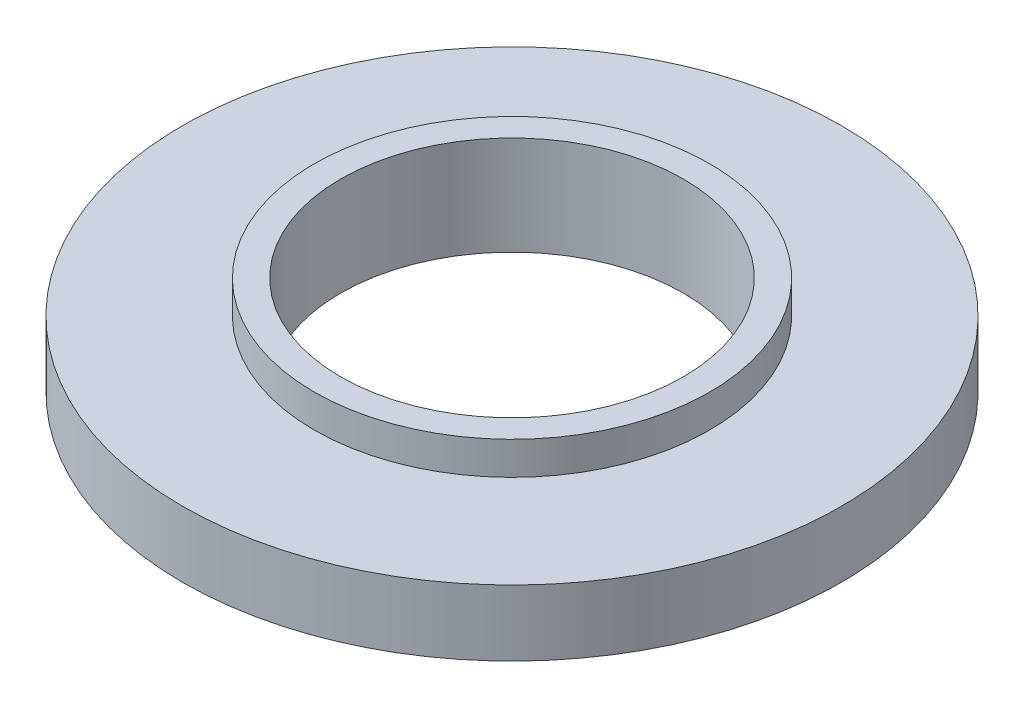
ISO-10303-21;
HEADER;
FILE_DESCRIPTION(('STEP AP214'),'2;1');
FILE_NAME('part.step','',(''),(''),'','','');
FILE_SCHEMA(('AUTOMOTIVE_DESIGN { 1 0 10303 214 1 1 1 1 }'));
ENDSEC;
DATA;
#1=APPLICATION_CONTEXT('core data for automotive mechanical design processes');
#2=APPLICATION_PROTOCOL_DEFINITION('international standard','automotive_design',2000,#1);
#3=PRODUCT_CONTEXT('',#1,'mechanical');
#4=PRODUCT('Part','Part','',(#3));
#5=PRODUCT_RELATED_PRODUCT_CATEGORY('part','',(#4));
#6=PRODUCT_DEFINITION_FORMATION('','',#4);
#7=PRODUCT_DEFINITION_CONTEXT('part definition',#1,'design');
#8=PRODUCT_DEFINITION('design','',#6,#7);
#9=PRODUCT_DEFINITION_SHAPE('','',#8);
#10=(LENGTH_UNIT() NAMED_UNIT(*) SI_UNIT(.MILLI.,.METRE.));
#11=(NAMED_UNIT(*) PLANE_ANGLE_UNIT() SI_UNIT($,.RADIAN.));
#12=(NAMED_UNIT(*) SI_UNIT($,.STERADIAN.) SOLID_ANGLE_UNIT());
#13=UNCERTAINTY_MEASURE_WITH_UNIT(LENGTH_MEASURE(1.E-05),#10,'distance_accuracy_value','');
#14=(GEOMETRIC_REPRESENTATION_CONTEXT(3) GLOBAL_UNCERTAINTY_ASSIGNED_CONTEXT((#13)) GLOBAL_UNIT_ASSIGNED_CONTEXT((#10,
#11,#12)) REPRESENTATION_CONTEXT('',''));
#15=CARTESIAN_POINT('',(0.,0.,0.));
#16=DIRECTION('',(0.,0.,1.));
#17=DIRECTION('',(1.,0.,0.));
#18=AXIS2_PLACEMENT_3D('',#15,#16,#17);
#19=CARTESIAN_POINT('',(2.6,1.5,0.));
#20=DIRECTION('',(0.,-1.,0.));
#21=DIRECTION('',(0.,0.,-1.));
#22=AXIS2_PLACEMENT_3D('',#19,#20,#21);
#23=PLANE('',#22);
#24=CARTESIAN_POINT('',(0.,1.5,0.));
#25=DIRECTION('',(0.,1.,0.));
#26=DIRECTION('',(0.,0.,1.));
#27=AXIS2_PLACEMENT_3D('',#24,#25,#26);
#28=CIRCLE('',#27,2.6);
#29=CARTESIAN_POINT('',(0.,1.5,2.6));
#30=VERTEX_POINT('',#29);
#31=EDGE_CURVE('E68',#30,#30,#28,.T.);
#32=ORIENTED_EDGE('',*,*,#31,.F.);
#33=EDGE_LOOP('',(#32));
#34=FACE_BOUND('',#33,.T.);
#35=CARTESIAN_POINT('',(0.,1.5,0.));
#36=DIRECTION('',(0.,1.,0.));
#37=DIRECTION('',(0.,0.,1.));
#38=AXIS2_PLACEMENT_3D('',#35,#36,#37);
#39=CIRCLE('',#38,3.);
#40=CARTESIAN_POINT('',(0.,1.5,3.));
#41=VERTEX_POINT('',#40);
#42=EDGE_CURVE('E10',#41,#41,#39,.T.);
#43=ORIENTED_EDGE('',*,*,#42,.T.);
#44=EDGE_LOOP('',(#43));
#45=FACE_BOUND('',#44,.T.);
#46=ADVANCED_FACE('F41',(#34,#45),#23,.F.);
#47=CARTESIAN_POINT('',(0.,8.66096866096866,0.));
#48=DIRECTION('',(0.,1.,0.));
#49=DIRECTION('',(0.,0.,1.));
#50=AXIS2_PLACEMENT_3D('',#47,#48,#49);
#51=CYLINDRICAL_SURFACE('',#50,3.);
#52=ORIENTED_EDGE('',*,*,#42,.F.);
#53=EDGE_LOOP('',(#52));
#54=FACE_BOUND('',#53,.T.);
#55=CARTESIAN_POINT('',(0.,1.,0.));
#56=DIRECTION('',(0.,1.,0.));
#57=DIRECTION('',(0.,0.,1.));
#58=AXIS2_PLACEMENT_3D('',#55,#56,#57);
#59=CIRCLE('',#58,3.);
#60=CARTESIAN_POINT('',(0.,1.,3.));
#61=VERTEX_POINT('',#60);
#62=EDGE_CURVE('E48',#61,#61,#59,.T.);
#63=ORIENTED_EDGE('',*,*,#62,.T.);
#64=EDGE_LOOP('',(#63));
#65=FACE_BOUND('',#64,.T.);
#66=ADVANCED_FACE('F76',(#54,#65),#51,.T.);
#67=CARTESIAN_POINT('',(3.,1.,0.));
#68=DIRECTION('',(0.,-1.,0.));
#69=DIRECTION('',(0.,0.,-1.));
#70=AXIS2_PLACEMENT_3D('',#67,#68,#69);
#71=PLANE('',#70);
#72=ORIENTED_EDGE('',*,*,#62,.F.);
#73=EDGE_LOOP('',(#72));
#74=FACE_BOUND('',#73,.T.);
#75=CARTESIAN_POINT('',(0.,1.,0.));
#76=DIRECTION('',(0.,1.,0.));
#77=DIRECTION('',(0.,0.,1.));
#78=AXIS2_PLACEMENT_3D('',#75,#76,#77);
#79=CIRCLE('',#78,5.);
#80=CARTESIAN_POINT('',(0.,1.,5.));
#81=VERTEX_POINT('',#80);
#82=EDGE_CURVE('E53',#81,#81,#79,.T.);
#83=ORIENTED_EDGE('',*,*,#82,.T.);
#84=EDGE_LOOP('',(#83));
#85=FACE_BOUND('',#84,.T.);
#86=ADVANCED_FACE('F80',(#74,#85),#71,.F.);
#87=CARTESIAN_POINT('',(0.,8.66096866096866,0.));
#88=DIRECTION('',(0.,1.,0.));
#89=DIRECTION('',(0.,0.,1.));
#90=AXIS2_PLACEMENT_3D('',#87,#88,#89);
#91=CYLINDRICAL_SURFACE('',#90,5.);
#92=ORIENTED_EDGE('',*,*,#82,.F.);
#93=EDGE_LOOP('',(#92));
#94=FACE_BOUND('',#93,.T.);
#95=CARTESIAN_POINT('',(0.,0.,0.));
#96=DIRECTION('',(0.,1.,0.));
#97=DIRECTION('',(0.,0.,1.));
#98=AXIS2_PLACEMENT_3D('',#95,#96,#97);
#99=CIRCLE('',#98,5.);
#100=CARTESIAN_POINT('',(0.,0.,5.));
#101=VERTEX_POINT('',#100);
#102=EDGE_CURVE('E58',#101,#101,#99,.T.);
#103=ORIENTED_EDGE('',*,*,#102,.T.);
#104=EDGE_LOOP('',(#103));
#105=FACE_BOUND('',#104,.T.);
#106=ADVANCED_FACE('F85',(#94,#105),#91,.T.);
#107=CARTESIAN_POINT('',(5.,0.,0.));
#108=DIRECTION('',(0.,1.,0.));
#109=DIRECTION('',(0.,0.,1.));
#110=AXIS2_PLACEMENT_3D('',#107,#108,#109);
#111=PLANE('',#110);
#112=ORIENTED_EDGE('',*,*,#102,.F.);
#113=EDGE_LOOP('',(#112));
#114=FACE_BOUND('',#113,.T.);
#115=CARTESIAN_POINT('',(0.,0.,0.));
#116=DIRECTION('',(0.,1.,0.));
#117=DIRECTION('',(0.,0.,1.));
#118=AXIS2_PLACEMENT_3D('',#115,#116,#117);
#119=CIRCLE('',#118,2.6);
#120=CARTESIAN_POINT('',(0.,0.,2.6));
#121=VERTEX_POINT('',#120);
#122=EDGE_CURVE('E64',#121,#121,#119,.T.);
#123=ORIENTED_EDGE('',*,*,#122,.T.);
#124=EDGE_LOOP('',(#123));
#125=FACE_BOUND('',#124,.T.);
#126=ADVANCED_FACE('F91',(#114,#125),#111,.F.);
#127=CARTESIAN_POINT('',(0.,8.66096866096866,0.));
#128=DIRECTION('',(0.,1.,0.));
#129=DIRECTION('',(0.,0.,1.));
#130=AXIS2_PLACEMENT_3D('',#127,#128,#129);
#131=CYLINDRICAL_SURFACE('',#130,2.6);
#132=ORIENTED_EDGE('',*,*,#122,.F.);
#133=EDGE_LOOP('',(#132));
#134=FACE_BOUND('',#133,.T.);
#135=ORIENTED_EDGE('',*,*,#31,.T.);
#136=EDGE_LOOP('',(#135));
#137=FACE_BOUND('',#136,.T.);
#138=ADVANCED_FACE('F73',(#134,#137),#131,.F.);
#139=CLOSED_SHELL('',(#46,#66,#86,#106,#126,#138));
#140=MANIFOLD_SOLID_BREP('B2',#139);
#141=ADVANCED_BREP_SHAPE_REPRESENTATION('',(#18,#140),#14);
#142=SHAPE_DEFINITION_REPRESENTATION(#9,#141);
ENDSEC;
END-ISO-10303-21;
